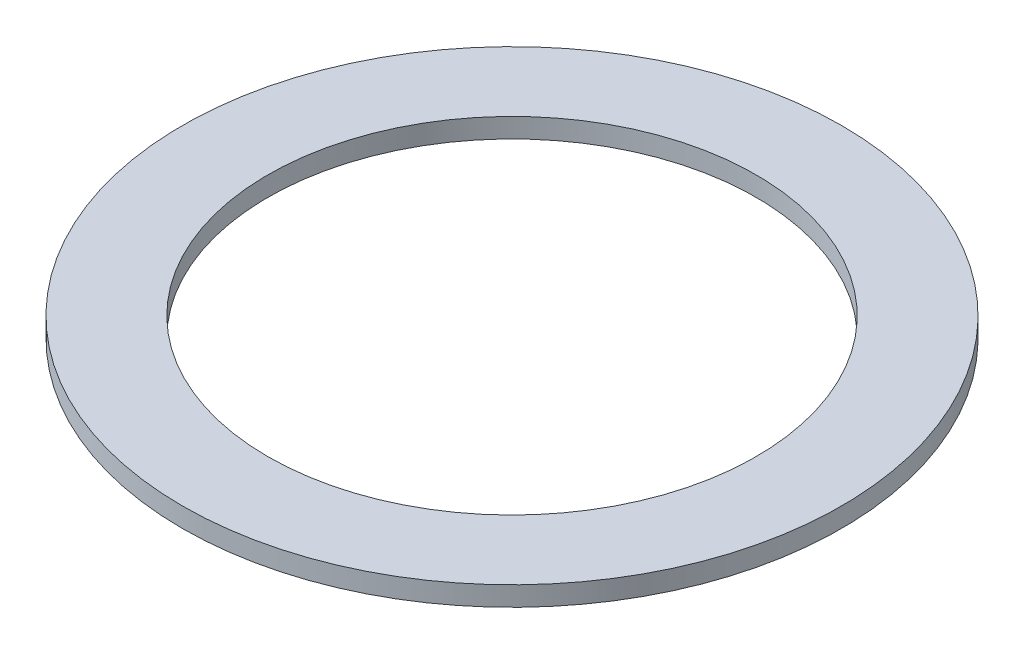
ISO-10303-21;
HEADER;
FILE_DESCRIPTION(('STEP AP214'),'2;1');
FILE_NAME('part.step','',(''),(''),'','','');
FILE_SCHEMA(('AUTOMOTIVE_DESIGN { 1 0 10303 214 1 1 1 1 }'));
ENDSEC;
DATA;
#1=APPLICATION_CONTEXT('core data for automotive mechanical design processes');
#2=APPLICATION_PROTOCOL_DEFINITION('international standard','automotive_design',2000,#1);
#3=PRODUCT_CONTEXT('',#1,'mechanical');
#4=PRODUCT('Part','Part','',(#3));
#5=PRODUCT_RELATED_PRODUCT_CATEGORY('part','',(#4));
#6=PRODUCT_DEFINITION_FORMATION('','',#4);
#7=PRODUCT_DEFINITION_CONTEXT('part definition',#1,'design');
#8=PRODUCT_DEFINITION('design','',#6,#7);
#9=PRODUCT_DEFINITION_SHAPE('','',#8);
#10=(LENGTH_UNIT() NAMED_UNIT(*) SI_UNIT(.MILLI.,.METRE.));
#11=(NAMED_UNIT(*) PLANE_ANGLE_UNIT() SI_UNIT($,.RADIAN.));
#12=(NAMED_UNIT(*) SI_UNIT($,.STERADIAN.) SOLID_ANGLE_UNIT());
#13=UNCERTAINTY_MEASURE_WITH_UNIT(LENGTH_MEASURE(1.E-05),#10,'distance_accuracy_value','');
#14=(GEOMETRIC_REPRESENTATION_CONTEXT(3) GLOBAL_UNCERTAINTY_ASSIGNED_CONTEXT((#13)) GLOBAL_UNIT_ASSIGNED_CONTEXT((#10,
#11,#12)) REPRESENTATION_CONTEXT('',''));
#15=CARTESIAN_POINT('',(0.,0.,0.));
#16=DIRECTION('',(0.,0.,1.));
#17=DIRECTION('',(1.,0.,0.));
#18=AXIS2_PLACEMENT_3D('',#15,#16,#17);
#19=CARTESIAN_POINT('',(0.,4.,0.));
#20=DIRECTION('',(0.,-1.,0.));
#21=DIRECTION('',(0.,0.,-1.));
#22=AXIS2_PLACEMENT_3D('',#19,#20,#21);
#23=CYLINDRICAL_SURFACE('',#22,67.5);
#24=CARTESIAN_POINT('',(0.,4.,0.));
#25=DIRECTION('',(0.,1.,0.));
#26=DIRECTION('',(0.,0.,1.));
#27=AXIS2_PLACEMENT_3D('',#24,#25,#26);
#28=CIRCLE('',#27,67.5);
#29=CARTESIAN_POINT('',(0.,4.,67.5));
#30=VERTEX_POINT('',#29);
#31=EDGE_CURVE('E10',#30,#30,#28,.T.);
#32=ORIENTED_EDGE('',*,*,#31,.F.);
#33=EDGE_LOOP('',(#32));
#34=FACE_BOUND('',#33,.T.);
#35=CARTESIAN_POINT('',(0.,0.,0.));
#36=DIRECTION('',(0.,1.,0.));
#37=DIRECTION('',(0.,0.,1.));
#38=AXIS2_PLACEMENT_3D('',#35,#36,#37);
#39=CIRCLE('',#38,67.5);
#40=CARTESIAN_POINT('',(0.,0.,67.5));
#41=VERTEX_POINT('',#40);
#42=EDGE_CURVE('E37',#41,#41,#39,.T.);
#43=ORIENTED_EDGE('',*,*,#42,.T.);
#44=EDGE_LOOP('',(#43));
#45=FACE_BOUND('',#44,.T.);
#46=ADVANCED_FACE('F40',(#34,#45),#23,.T.);
#47=CARTESIAN_POINT('',(0.,4.,0.));
#48=DIRECTION('',(0.,1.,0.));
#49=DIRECTION('',(0.,0.,1.));
#50=AXIS2_PLACEMENT_3D('',#47,#48,#49);
#51=PLANE('',#50);
#52=CARTESIAN_POINT('',(0.,4.,0.));
#53=DIRECTION('',(0.,1.,0.));
#54=DIRECTION('',(0.,0.,1.));
#55=AXIS2_PLACEMENT_3D('',#52,#53,#54);
#56=CIRCLE('',#55,50.);
#57=CARTESIAN_POINT('',(0.,4.,50.));
#58=VERTEX_POINT('',#57);
#59=EDGE_CURVE('E50',#58,#58,#56,.T.);
#60=ORIENTED_EDGE('',*,*,#59,.F.);
#61=EDGE_LOOP('',(#60));
#62=FACE_BOUND('',#61,.T.);
#63=ORIENTED_EDGE('',*,*,#31,.T.);
#64=EDGE_LOOP('',(#63));
#65=FACE_BOUND('',#64,.T.);
#66=ADVANCED_FACE('F59',(#62,#65),#51,.T.);
#67=CARTESIAN_POINT('',(0.,0.,0.));
#68=DIRECTION('',(0.,1.,0.));
#69=DIRECTION('',(0.,0.,1.));
#70=AXIS2_PLACEMENT_3D('',#67,#68,#69);
#71=PLANE('',#70);
#72=CARTESIAN_POINT('',(0.,0.,0.));
#73=DIRECTION('',(0.,1.,0.));
#74=DIRECTION('',(0.,0.,1.));
#75=AXIS2_PLACEMENT_3D('',#72,#73,#74);
#76=CIRCLE('',#75,50.);
#77=CARTESIAN_POINT('',(0.,0.,50.));
#78=VERTEX_POINT('',#77);
#79=EDGE_CURVE('E47',#78,#78,#76,.T.);
#80=ORIENTED_EDGE('',*,*,#79,.T.);
#81=EDGE_LOOP('',(#80));
#82=FACE_BOUND('',#81,.T.);
#83=ORIENTED_EDGE('',*,*,#42,.F.);
#84=EDGE_LOOP('',(#83));
#85=FACE_BOUND('',#84,.T.);
#86=ADVANCED_FACE('F58',(#82,#85),#71,.F.);
#87=CARTESIAN_POINT('',(0.,4.,0.));
#88=DIRECTION('',(0.,-1.,0.));
#89=DIRECTION('',(0.,0.,-1.));
#90=AXIS2_PLACEMENT_3D('',#87,#88,#89);
#91=CYLINDRICAL_SURFACE('',#90,50.);
#92=ORIENTED_EDGE('',*,*,#59,.T.);
#93=EDGE_LOOP('',(#92));
#94=FACE_BOUND('',#93,.T.);
#95=ORIENTED_EDGE('',*,*,#79,.F.);
#96=EDGE_LOOP('',(#95));
#97=FACE_BOUND('',#96,.T.);
#98=ADVANCED_FACE('F54',(#94,#97),#91,.F.);
#99=CLOSED_SHELL('',(#46,#66,#86,#98));
#100=MANIFOLD_SOLID_BREP('B2',#99);
#101=ADVANCED_BREP_SHAPE_REPRESENTATION('',(#18,#100),#14);
#102=SHAPE_DEFINITION_REPRESENTATION(#9,#101);
ENDSEC;
END-ISO-10303-21;
